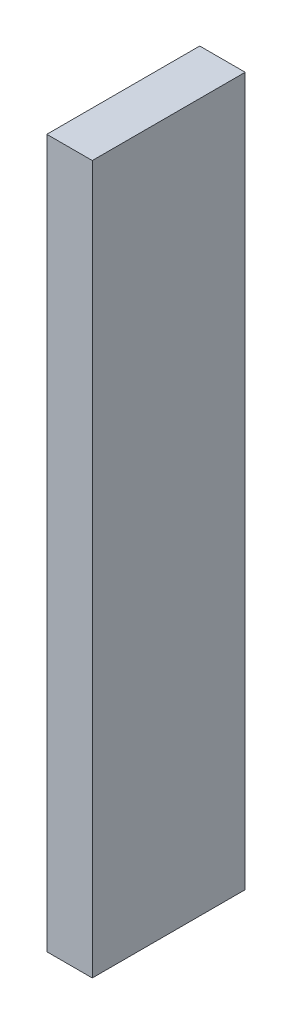
ISO-10303-21;
HEADER;
FILE_DESCRIPTION(('STEP AP214'),'2;1');
FILE_NAME('part.step','',(''),(''),'','','');
FILE_SCHEMA(('AUTOMOTIVE_DESIGN { 1 0 10303 214 1 1 1 1 }'));
ENDSEC;
DATA;
#1=APPLICATION_CONTEXT('core data for automotive mechanical design processes');
#2=APPLICATION_PROTOCOL_DEFINITION('international standard','automotive_design',2000,#1);
#3=PRODUCT_CONTEXT('',#1,'mechanical');
#4=PRODUCT('Part','Part','',(#3));
#5=PRODUCT_RELATED_PRODUCT_CATEGORY('part','',(#4));
#6=PRODUCT_DEFINITION_FORMATION('','',#4);
#7=PRODUCT_DEFINITION_CONTEXT('part definition',#1,'design');
#8=PRODUCT_DEFINITION('design','',#6,#7);
#9=PRODUCT_DEFINITION_SHAPE('','',#8);
#10=(LENGTH_UNIT() NAMED_UNIT(*) SI_UNIT(.MILLI.,.METRE.));
#11=(NAMED_UNIT(*) PLANE_ANGLE_UNIT() SI_UNIT($,.RADIAN.));
#12=(NAMED_UNIT(*) SI_UNIT($,.STERADIAN.) SOLID_ANGLE_UNIT());
#13=UNCERTAINTY_MEASURE_WITH_UNIT(LENGTH_MEASURE(1.E-05),#10,'distance_accuracy_value','');
#14=(GEOMETRIC_REPRESENTATION_CONTEXT(3) GLOBAL_UNCERTAINTY_ASSIGNED_CONTEXT((#13)) GLOBAL_UNIT_ASSIGNED_CONTEXT((#10,
#11,#12)) REPRESENTATION_CONTEXT('',''));
#15=CARTESIAN_POINT('',(0.,0.,0.));
#16=DIRECTION('',(0.,0.,1.));
#17=DIRECTION('',(1.,0.,0.));
#18=AXIS2_PLACEMENT_3D('',#15,#16,#17);
#19=CARTESIAN_POINT('',(130.275545170168,22.4180708263693,111.072028202897));
#20=DIRECTION('',(-1.69244514382854E-09,0.,1.));
#21=DIRECTION('',(1.,0.,1.69244514382854E-09));
#22=AXIS2_PLACEMENT_3D('',#19,#20,#21);
#23=PLANE('',#22);
#24=DIRECTION('',(0.,-1.,0.));
#25=VECTOR('',#24,1.);
#26=CARTESIAN_POINT('',(131.258630267181,22.4180708263693,111.072028204561));
#27=LINE('',#26,#25);
#28=CARTESIAN_POINT('',(131.258630267181,22.4180708263693,111.072028204561));
#29=VERTEX_POINT('',#28);
#30=CARTESIAN_POINT('',(131.258630267181,7.11212965552235,111.072028204561));
#31=VERTEX_POINT('',#30);
#32=EDGE_CURVE('E79',#29,#31,#27,.T.);
#33=ORIENTED_EDGE('',*,*,#32,.F.);
#34=DIRECTION('',(1.,0.,1.69244514382854E-09));
#35=VECTOR('',#34,1.);
#36=CARTESIAN_POINT('',(130.275545170168,22.4180708263693,111.072028202897));
#37=LINE('',#36,#35);
#38=CARTESIAN_POINT('',(130.275545170168,22.4180708263693,111.072028202897));
#39=VERTEX_POINT('',#38);
#40=EDGE_CURVE('E32',#39,#29,#37,.T.);
#41=ORIENTED_EDGE('',*,*,#40,.F.);
#42=DIRECTION('',(0.,-1.,0.));
#43=VECTOR('',#42,1.);
#44=CARTESIAN_POINT('',(130.275545170168,22.4180708263693,111.072028202897));
#45=LINE('',#44,#43);
#46=CARTESIAN_POINT('',(130.275545170168,7.11212965552235,111.072028202897));
#47=VERTEX_POINT('',#46);
#48=EDGE_CURVE('E71',#39,#47,#45,.T.);
#49=ORIENTED_EDGE('',*,*,#48,.T.);
#50=DIRECTION('',(1.,0.,1.69244514382854E-09));
#51=VECTOR('',#50,1.);
#52=CARTESIAN_POINT('',(130.275545170168,7.11212965552235,111.072028202897));
#53=LINE('',#52,#51);
#54=EDGE_CURVE('E10',#47,#31,#53,.T.);
#55=ORIENTED_EDGE('',*,*,#54,.T.);
#56=EDGE_LOOP('',(#33,#41,#49,#55));
#57=FACE_BOUND('',#56,.T.);
#58=ADVANCED_FACE('F16',(#57),#23,.T.);
#59=CARTESIAN_POINT('',(130.275545170168,7.11212965552235,111.072028202897));
#60=DIRECTION('',(0.,-1.,0.));
#61=DIRECTION('',(0.,0.,-1.));
#62=AXIS2_PLACEMENT_3D('',#59,#60,#61);
#63=PLANE('',#62);
#64=DIRECTION('',(1.69244514382854E-09,0.,-1.));
#65=VECTOR('',#64,1.);
#66=CARTESIAN_POINT('',(131.258630267181,7.11212965552235,111.072028204561));
#67=LINE('',#66,#65);
#68=CARTESIAN_POINT('',(131.258630272776,7.11212965552235,107.766087033712));
#69=VERTEX_POINT('',#68);
#70=EDGE_CURVE('E82',#31,#69,#67,.T.);
#71=ORIENTED_EDGE('',*,*,#70,.F.);
#72=ORIENTED_EDGE('',*,*,#54,.F.);
#73=DIRECTION('',(1.69244514382854E-09,0.,-1.));
#74=VECTOR('',#73,1.);
#75=CARTESIAN_POINT('',(130.275545170168,7.11212965552235,111.072028202897));
#76=LINE('',#75,#74);
#77=CARTESIAN_POINT('',(130.275545175763,7.11212965552235,107.766087032048));
#78=VERTEX_POINT('',#77);
#79=EDGE_CURVE('E67',#47,#78,#76,.T.);
#80=ORIENTED_EDGE('',*,*,#79,.T.);
#81=DIRECTION('',(1.,0.,1.69244514382854E-09));
#82=VECTOR('',#81,1.);
#83=CARTESIAN_POINT('',(130.275545175763,7.11212965552235,107.766087032048));
#84=LINE('',#83,#82);
#85=EDGE_CURVE('E24',#78,#69,#84,.T.);
#86=ORIENTED_EDGE('',*,*,#85,.T.);
#87=EDGE_LOOP('',(#71,#72,#80,#86));
#88=FACE_BOUND('',#87,.T.);
#89=ADVANCED_FACE('F68',(#88),#63,.T.);
#90=CARTESIAN_POINT('',(130.275545175763,7.11212965552235,107.766087032048));
#91=DIRECTION('',(1.69244514382854E-09,0.,-1.));
#92=DIRECTION('',(-1.,0.,-1.69244514382854E-09));
#93=AXIS2_PLACEMENT_3D('',#90,#91,#92);
#94=PLANE('',#93);
#95=DIRECTION('',(0.,1.,0.));
#96=VECTOR('',#95,1.);
#97=CARTESIAN_POINT('',(131.258630272776,7.11212965552235,107.766087033712));
#98=LINE('',#97,#96);
#99=CARTESIAN_POINT('',(131.258630272776,22.418070826371,107.766087025251));
#100=VERTEX_POINT('',#99);
#101=EDGE_CURVE('E65',#69,#100,#98,.T.);
#102=ORIENTED_EDGE('',*,*,#101,.F.);
#103=ORIENTED_EDGE('',*,*,#85,.F.);
#104=DIRECTION('',(0.,1.,0.));
#105=VECTOR('',#104,1.);
#106=CARTESIAN_POINT('',(130.275545175763,7.11212965552235,107.766087032048));
#107=LINE('',#106,#105);
#108=CARTESIAN_POINT('',(130.275545175763,22.418070826371,107.766087023588));
#109=VERTEX_POINT('',#108);
#110=EDGE_CURVE('E62',#78,#109,#107,.T.);
#111=ORIENTED_EDGE('',*,*,#110,.T.);
#112=DIRECTION('',(1.,0.,1.69244514382854E-09));
#113=VECTOR('',#112,1.);
#114=CARTESIAN_POINT('',(130.275545175763,22.418070826371,107.766087023588));
#115=LINE('',#114,#113);
#116=EDGE_CURVE('E48',#109,#100,#115,.T.);
#117=ORIENTED_EDGE('',*,*,#116,.T.);
#118=EDGE_LOOP('',(#102,#103,#111,#117));
#119=FACE_BOUND('',#118,.T.);
#120=ADVANCED_FACE('F60',(#119),#94,.T.);
#121=CARTESIAN_POINT('',(130.275545175763,22.418070826371,107.766087023588));
#122=DIRECTION('',(0.,1.,0.));
#123=DIRECTION('',(-1.,0.,0.));
#124=AXIS2_PLACEMENT_3D('',#121,#122,#123);
#125=PLANE('',#124);
#126=DIRECTION('',(-1.69244514382854E-09,0.,1.));
#127=VECTOR('',#126,1.);
#128=CARTESIAN_POINT('',(131.258630272776,22.418070826371,107.766087025251));
#129=LINE('',#128,#127);
#130=EDGE_CURVE('E85',#100,#29,#129,.T.);
#131=ORIENTED_EDGE('',*,*,#130,.F.);
#132=ORIENTED_EDGE('',*,*,#116,.F.);
#133=DIRECTION('',(-1.69244514382854E-09,0.,1.));
#134=VECTOR('',#133,1.);
#135=CARTESIAN_POINT('',(130.275545175763,22.418070826371,107.766087023588));
#136=LINE('',#135,#134);
#137=EDGE_CURVE('E74',#109,#39,#136,.T.);
#138=ORIENTED_EDGE('',*,*,#137,.T.);
#139=ORIENTED_EDGE('',*,*,#40,.T.);
#140=EDGE_LOOP('',(#131,#132,#138,#139));
#141=FACE_BOUND('',#140,.T.);
#142=ADVANCED_FACE('F96',(#141),#125,.T.);
#143=CARTESIAN_POINT('',(130.275545201028,17.2651002409467,92.8378644340291));
#144=DIRECTION('',(1.,0.,1.69244514382854E-09));
#145=DIRECTION('',(0.,1.,0.));
#146=AXIS2_PLACEMENT_3D('',#143,#144,#145);
#147=PLANE('',#146);
#148=ORIENTED_EDGE('',*,*,#48,.F.);
#149=ORIENTED_EDGE('',*,*,#137,.F.);
#150=ORIENTED_EDGE('',*,*,#110,.F.);
#151=ORIENTED_EDGE('',*,*,#79,.F.);
#152=EDGE_LOOP('',(#148,#149,#150,#151));
#153=FACE_BOUND('',#152,.T.);
#154=ADVANCED_FACE('F73',(#153),#147,.F.);
#155=CARTESIAN_POINT('',(131.258630298041,17.2651002409467,92.8378644356929));
#156=DIRECTION('',(1.,0.,1.69244514382854E-09));
#157=DIRECTION('',(0.,1.,0.));
#158=AXIS2_PLACEMENT_3D('',#155,#156,#157);
#159=PLANE('',#158);
#160=ORIENTED_EDGE('',*,*,#32,.T.);
#161=ORIENTED_EDGE('',*,*,#70,.T.);
#162=ORIENTED_EDGE('',*,*,#101,.T.);
#163=ORIENTED_EDGE('',*,*,#130,.T.);
#164=EDGE_LOOP('',(#160,#161,#162,#163));
#165=FACE_BOUND('',#164,.T.);
#166=ADVANCED_FACE('F89',(#165),#159,.T.);
#167=CLOSED_SHELL('',(#58,#89,#120,#142,#154,#166));
#168=MANIFOLD_SOLID_BREP('B1',#167);
#169=ADVANCED_BREP_SHAPE_REPRESENTATION('',(#18,#168),#14);
#170=SHAPE_DEFINITION_REPRESENTATION(#9,#169);
ENDSEC;
END-ISO-10303-21;
